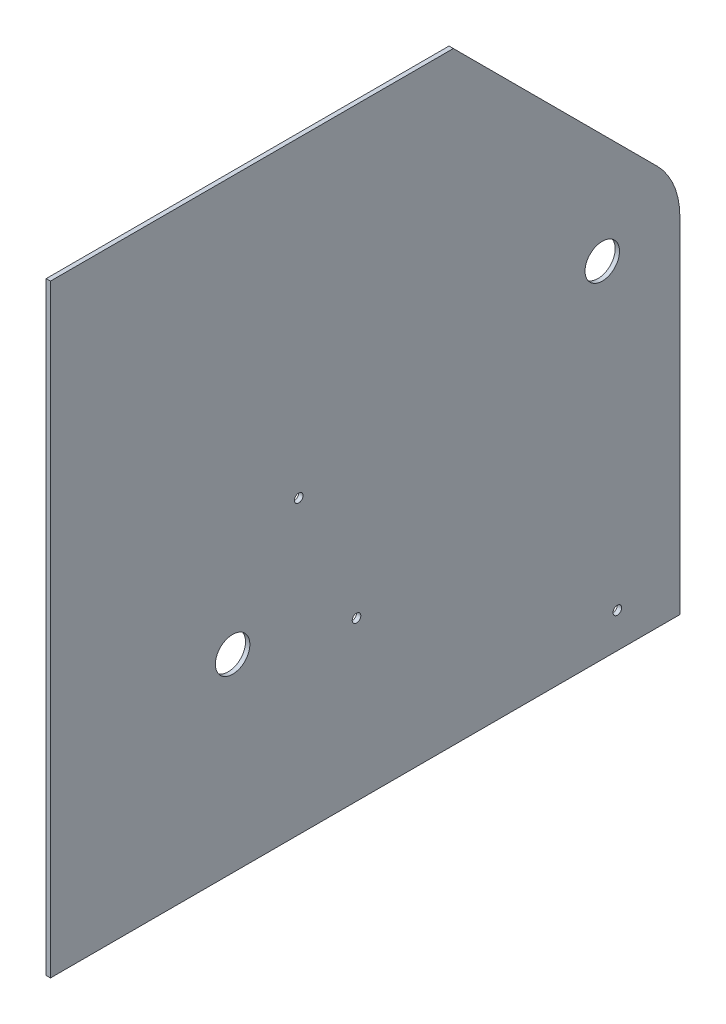
ISO-10303-21;
HEADER;
FILE_DESCRIPTION(('STEP AP214'),'2;1');
FILE_NAME('part.step','',(''),(''),'','','');
FILE_SCHEMA(('AUTOMOTIVE_DESIGN { 1 0 10303 214 1 1 1 1 }'));
ENDSEC;
DATA;
#1=APPLICATION_CONTEXT('core data for automotive mechanical design processes');
#2=APPLICATION_PROTOCOL_DEFINITION('international standard','automotive_design',2000,#1);
#3=PRODUCT_CONTEXT('',#1,'mechanical');
#4=PRODUCT('Part','Part','',(#3));
#5=PRODUCT_RELATED_PRODUCT_CATEGORY('part','',(#4));
#6=PRODUCT_DEFINITION_FORMATION('','',#4);
#7=PRODUCT_DEFINITION_CONTEXT('part definition',#1,'design');
#8=PRODUCT_DEFINITION('design','',#6,#7);
#9=PRODUCT_DEFINITION_SHAPE('','',#8);
#10=(LENGTH_UNIT() NAMED_UNIT(*) SI_UNIT(.MILLI.,.METRE.));
#11=(NAMED_UNIT(*) PLANE_ANGLE_UNIT() SI_UNIT($,.RADIAN.));
#12=(NAMED_UNIT(*) SI_UNIT($,.STERADIAN.) SOLID_ANGLE_UNIT());
#13=UNCERTAINTY_MEASURE_WITH_UNIT(LENGTH_MEASURE(1.E-05),#10,'distance_accuracy_value','');
#14=(GEOMETRIC_REPRESENTATION_CONTEXT(3) GLOBAL_UNCERTAINTY_ASSIGNED_CONTEXT((#13)) GLOBAL_UNIT_ASSIGNED_CONTEXT((#10,
#11,#12)) REPRESENTATION_CONTEXT('',''));
#15=CARTESIAN_POINT('',(0.,0.,0.));
#16=DIRECTION('',(0.,0.,1.));
#17=DIRECTION('',(1.,0.,0.));
#18=AXIS2_PLACEMENT_3D('',#15,#16,#17);
#19=CARTESIAN_POINT('',(3.175,0.,0.));
#20=DIRECTION('',(-1.,0.,0.));
#21=DIRECTION('',(0.,0.,1.));
#22=AXIS2_PLACEMENT_3D('',#19,#20,#21);
#23=CYLINDRICAL_SURFACE('',#22,57.1499999999999);
#24=DIRECTION('',(1.,0.,0.));
#25=VECTOR('',#24,1.);
#26=CARTESIAN_POINT('',(-631.886391748424,40.4111525448111,-40.411152544811));
#27=LINE('',#26,#25);
#28=CARTESIAN_POINT('',(0.,40.4111525448112,-40.411152544811));
#29=VERTEX_POINT('',#28);
#30=CARTESIAN_POINT('',(3.175,40.4111525448112,-40.411152544811));
#31=VERTEX_POINT('',#30);
#32=EDGE_CURVE('E58',#29,#31,#27,.T.);
#33=ORIENTED_EDGE('',*,*,#32,.T.);
#34=CARTESIAN_POINT('',(3.175,0.,0.));
#35=DIRECTION('',(1.,0.,0.));
#36=DIRECTION('',(0.,0.,-1.));
#37=AXIS2_PLACEMENT_3D('',#34,#35,#36);
#38=CIRCLE('',#37,57.1499999999999);
#39=CARTESIAN_POINT('',(3.175,0.,-57.1499999999999));
#40=VERTEX_POINT('',#39);
#41=EDGE_CURVE('E149',#40,#31,#38,.T.);
#42=ORIENTED_EDGE('',*,*,#41,.F.);
#43=DIRECTION('',(-1.,0.,0.));
#44=VECTOR('',#43,1.);
#45=CARTESIAN_POINT('',(3.175,0.,-57.1499999999999));
#46=LINE('',#45,#44);
#47=CARTESIAN_POINT('',(0.,0.,-57.1499999999999));
#48=VERTEX_POINT('',#47);
#49=EDGE_CURVE('E151',#40,#48,#46,.T.);
#50=ORIENTED_EDGE('',*,*,#49,.T.);
#51=CARTESIAN_POINT('',(0.,0.,0.));
#52=DIRECTION('',(1.,0.,0.));
#53=DIRECTION('',(0.,0.,-1.));
#54=AXIS2_PLACEMENT_3D('',#51,#52,#53);
#55=CIRCLE('',#54,57.1499999999999);
#56=EDGE_CURVE('E147',#48,#29,#55,.T.);
#57=ORIENTED_EDGE('',*,*,#56,.T.);
#58=EDGE_LOOP('',(#33,#42,#50,#57));
#59=FACE_BOUND('',#58,.T.);
#60=ADVANCED_FACE('F36',(#59),#23,.T.);
#61=CARTESIAN_POINT('',(3.175,0.,0.));
#62=DIRECTION('',(1.,0.,0.));
#63=DIRECTION('',(0.,0.,-1.));
#64=AXIS2_PLACEMENT_3D('',#61,#62,#63);
#65=PLANE('',#64);
#66=DIRECTION('',(0.,0.,-1.));
#67=VECTOR('',#66,1.);
#68=CARTESIAN_POINT('',(3.175,190.5,406.4));
#69=LINE('',#68,#67);
#70=CARTESIAN_POINT('',(3.175,190.5,406.4));
#71=VERTEX_POINT('',#70);
#72=CARTESIAN_POINT('',(3.175,190.5,109.677694910379));
#73=VERTEX_POINT('',#72);
#74=EDGE_CURVE('E50',#71,#73,#69,.T.);
#75=ORIENTED_EDGE('',*,*,#74,.F.);
#76=DIRECTION('',(0.,-1.,0.));
#77=VECTOR('',#76,1.);
#78=CARTESIAN_POINT('',(3.175,-254.,406.4));
#79=LINE('',#78,#77);
#80=CARTESIAN_POINT('',(3.175,-254.,406.4));
#81=VERTEX_POINT('',#80);
#82=EDGE_CURVE('E101',#71,#81,#79,.T.);
#83=ORIENTED_EDGE('',*,*,#82,.T.);
#84=DIRECTION('',(0.,0.,-1.));
#85=VECTOR('',#84,1.);
#86=CARTESIAN_POINT('',(3.175,-254.,-57.15));
#87=LINE('',#86,#85);
#88=CARTESIAN_POINT('',(3.175,-254.,-57.15));
#89=VERTEX_POINT('',#88);
#90=EDGE_CURVE('E144',#81,#89,#87,.T.);
#91=ORIENTED_EDGE('',*,*,#90,.T.);
#92=DIRECTION('',(0.,1.,0.));
#93=VECTOR('',#92,1.);
#94=CARTESIAN_POINT('',(3.175,0.,-57.15));
#95=LINE('',#94,#93);
#96=EDGE_CURVE('E146',#89,#40,#95,.T.);
#97=ORIENTED_EDGE('',*,*,#96,.T.);
#98=ORIENTED_EDGE('',*,*,#41,.T.);
#99=DIRECTION('',(0.,0.707106781186546,0.707106781186549));
#100=VECTOR('',#99,1.);
#101=CARTESIAN_POINT('',(3.175,40.4111525448111,-40.411152544811));
#102=LINE('',#101,#100);
#103=EDGE_CURVE('E104',#31,#73,#102,.T.);
#104=ORIENTED_EDGE('',*,*,#103,.T.);
#105=EDGE_LOOP('',(#75,#83,#91,#97,#98,#104));
#106=FACE_BOUND('',#105,.T.);
#107=CARTESIAN_POINT('',(3.175,-114.629596606952,272.235522473374));
#108=DIRECTION('',(1.,0.,0.));
#109=DIRECTION('',(0.,0.,-1.));
#110=AXIS2_PLACEMENT_3D('',#107,#108,#109);
#111=CIRCLE('',#110,12.7);
#112=CARTESIAN_POINT('',(3.175,-114.629596606952,259.535522473374));
#113=VERTEX_POINT('',#112);
#114=EDGE_CURVE('E115',#113,#113,#111,.T.);
#115=ORIENTED_EDGE('',*,*,#114,.F.);
#116=EDGE_LOOP('',(#115));
#117=FACE_BOUND('',#116,.T.);
#118=CARTESIAN_POINT('',(3.175,-137.156185968354,180.989788444896));
#119=DIRECTION('',(1.,0.,0.));
#120=DIRECTION('',(0.,0.,-1.));
#121=AXIS2_PLACEMENT_3D('',#118,#119,#120);
#122=CIRCLE('',#121,3.17499999999997);
#123=CARTESIAN_POINT('',(3.175,-137.156185968354,177.814788444896));
#124=VERTEX_POINT('',#123);
#125=EDGE_CURVE('E119',#124,#124,#122,.T.);
#126=ORIENTED_EDGE('',*,*,#125,.F.);
#127=EDGE_LOOP('',(#126));
#128=FACE_BOUND('',#127,.T.);
#129=CARTESIAN_POINT('',(3.175,-39.2772450904559,223.548763186676));
#130=DIRECTION('',(1.,0.,0.));
#131=DIRECTION('',(0.,0.,-1.));
#132=AXIS2_PLACEMENT_3D('',#129,#130,#131);
#133=CIRCLE('',#132,3.175);
#134=CARTESIAN_POINT('',(3.175,-39.2772450904559,220.373763186676));
#135=VERTEX_POINT('',#134);
#136=EDGE_CURVE('E127',#135,#135,#133,.T.);
#137=ORIENTED_EDGE('',*,*,#136,.F.);
#138=EDGE_LOOP('',(#137));
#139=FACE_BOUND('',#138,.T.);
#140=CARTESIAN_POINT('',(3.175,-228.181271675795,-11.1032891519149));
#141=DIRECTION('',(1.,0.,0.));
#142=DIRECTION('',(0.,0.,-1.));
#143=AXIS2_PLACEMENT_3D('',#140,#141,#142);
#144=CIRCLE('',#143,3.175);
#145=CARTESIAN_POINT('',(3.175,-228.181271675795,-14.2782891519149));
#146=VERTEX_POINT('',#145);
#147=EDGE_CURVE('E126',#146,#146,#144,.T.);
#148=ORIENTED_EDGE('',*,*,#147,.F.);
#149=EDGE_LOOP('',(#148));
#150=FACE_BOUND('',#149,.T.);
#151=CARTESIAN_POINT('',(3.175,0.,0.));
#152=DIRECTION('',(1.,0.,0.));
#153=DIRECTION('',(0.,0.,-1.));
#154=AXIS2_PLACEMENT_3D('',#151,#152,#153);
#155=CIRCLE('',#154,12.7);
#156=CARTESIAN_POINT('',(3.175,0.,-12.7));
#157=VERTEX_POINT('',#156);
#158=EDGE_CURVE('E138',#157,#157,#155,.T.);
#159=ORIENTED_EDGE('',*,*,#158,.F.);
#160=EDGE_LOOP('',(#159));
#161=FACE_BOUND('',#160,.T.);
#162=ADVANCED_FACE('F99',(#106,#117,#128,#139,#150,#161),#65,.T.);
#163=CARTESIAN_POINT('',(0.,0.,0.));
#164=DIRECTION('',(1.,0.,0.));
#165=DIRECTION('',(0.,0.,-1.));
#166=AXIS2_PLACEMENT_3D('',#163,#164,#165);
#167=PLANE('',#166);
#168=CARTESIAN_POINT('',(0.,-114.629596606952,272.235522473374));
#169=DIRECTION('',(1.,0.,0.));
#170=DIRECTION('',(0.,0.,-1.));
#171=AXIS2_PLACEMENT_3D('',#168,#169,#170);
#172=CIRCLE('',#171,12.7);
#173=CARTESIAN_POINT('',(0.,-114.629596606952,259.535522473374));
#174=VERTEX_POINT('',#173);
#175=EDGE_CURVE('E110',#174,#174,#172,.F.);
#176=ORIENTED_EDGE('',*,*,#175,.F.);
#177=EDGE_LOOP('',(#176));
#178=FACE_BOUND('',#177,.T.);
#179=CARTESIAN_POINT('',(0.,-137.156185968354,180.989788444896));
#180=DIRECTION('',(1.,0.,0.));
#181=DIRECTION('',(0.,0.,-1.));
#182=AXIS2_PLACEMENT_3D('',#179,#180,#181);
#183=CIRCLE('',#182,3.17499999999997);
#184=CARTESIAN_POINT('',(0.,-137.156185968354,177.814788444896));
#185=VERTEX_POINT('',#184);
#186=EDGE_CURVE('E122',#185,#185,#183,.F.);
#187=ORIENTED_EDGE('',*,*,#186,.F.);
#188=EDGE_LOOP('',(#187));
#189=FACE_BOUND('',#188,.T.);
#190=CARTESIAN_POINT('',(0.,-39.2772450904559,223.548763186676));
#191=DIRECTION('',(1.,0.,0.));
#192=DIRECTION('',(0.,0.,-1.));
#193=AXIS2_PLACEMENT_3D('',#190,#191,#192);
#194=CIRCLE('',#193,3.175);
#195=CARTESIAN_POINT('',(0.,-39.2772450904559,220.373763186676));
#196=VERTEX_POINT('',#195);
#197=EDGE_CURVE('E123',#196,#196,#194,.F.);
#198=ORIENTED_EDGE('',*,*,#197,.F.);
#199=EDGE_LOOP('',(#198));
#200=FACE_BOUND('',#199,.T.);
#201=CARTESIAN_POINT('',(0.,-228.181271675795,-11.1032891519149));
#202=DIRECTION('',(1.,0.,0.));
#203=DIRECTION('',(0.,0.,-1.));
#204=AXIS2_PLACEMENT_3D('',#201,#202,#203);
#205=CIRCLE('',#204,3.175);
#206=CARTESIAN_POINT('',(0.,-228.181271675795,-14.2782891519149));
#207=VERTEX_POINT('',#206);
#208=EDGE_CURVE('E134',#207,#207,#205,.F.);
#209=ORIENTED_EDGE('',*,*,#208,.F.);
#210=EDGE_LOOP('',(#209));
#211=FACE_BOUND('',#210,.T.);
#212=DIRECTION('',(0.,1.,0.));
#213=VECTOR('',#212,1.);
#214=CARTESIAN_POINT('',(0.,-254.,406.4));
#215=LINE('',#214,#213);
#216=CARTESIAN_POINT('',(0.,-254.,406.4));
#217=VERTEX_POINT('',#216);
#218=CARTESIAN_POINT('',(0.,190.5,406.4));
#219=VERTEX_POINT('',#218);
#220=EDGE_CURVE('E112',#217,#219,#215,.T.);
#221=ORIENTED_EDGE('',*,*,#220,.T.);
#222=DIRECTION('',(0.,0.,1.));
#223=VECTOR('',#222,1.);
#224=CARTESIAN_POINT('',(0.,190.5,406.4));
#225=LINE('',#224,#223);
#226=CARTESIAN_POINT('',(0.,190.5,109.677694910379));
#227=VERTEX_POINT('',#226);
#228=EDGE_CURVE('E91',#227,#219,#225,.T.);
#229=ORIENTED_EDGE('',*,*,#228,.F.);
#230=DIRECTION('',(0.,-0.707106781186546,-0.707106781186549));
#231=VECTOR('',#230,1.);
#232=CARTESIAN_POINT('',(0.,40.4111525448111,-40.411152544811));
#233=LINE('',#232,#231);
#234=EDGE_CURVE('E170',#227,#29,#233,.T.);
#235=ORIENTED_EDGE('',*,*,#234,.T.);
#236=ORIENTED_EDGE('',*,*,#56,.F.);
#237=DIRECTION('',(0.,1.,0.));
#238=VECTOR('',#237,1.);
#239=CARTESIAN_POINT('',(0.,0.,-57.15));
#240=LINE('',#239,#238);
#241=CARTESIAN_POINT('',(0.,-254.,-57.15));
#242=VERTEX_POINT('',#241);
#243=EDGE_CURVE('E153',#242,#48,#240,.T.);
#244=ORIENTED_EDGE('',*,*,#243,.F.);
#245=DIRECTION('',(0.,0.,-1.));
#246=VECTOR('',#245,1.);
#247=CARTESIAN_POINT('',(0.,-254.,-57.15));
#248=LINE('',#247,#246);
#249=EDGE_CURVE('E141',#217,#242,#248,.T.);
#250=ORIENTED_EDGE('',*,*,#249,.F.);
#251=EDGE_LOOP('',(#221,#229,#235,#236,#244,#250));
#252=FACE_BOUND('',#251,.T.);
#253=CARTESIAN_POINT('',(0.,0.,0.));
#254=DIRECTION('',(1.,0.,0.));
#255=DIRECTION('',(0.,0.,-1.));
#256=AXIS2_PLACEMENT_3D('',#253,#254,#255);
#257=CIRCLE('',#256,12.7);
#258=CARTESIAN_POINT('',(0.,0.,-12.7));
#259=VERTEX_POINT('',#258);
#260=EDGE_CURVE('E137',#259,#259,#257,.T.);
#261=ORIENTED_EDGE('',*,*,#260,.T.);
#262=EDGE_LOOP('',(#261));
#263=FACE_BOUND('',#262,.T.);
#264=ADVANCED_FACE('F167',(#178,#189,#200,#211,#252,#263),#167,.F.);
#265=CARTESIAN_POINT('',(3.175,-254.,-57.15));
#266=DIRECTION('',(0.,1.,0.));
#267=DIRECTION('',(0.,0.,1.));
#268=AXIS2_PLACEMENT_3D('',#265,#266,#267);
#269=PLANE('',#268);
#270=ORIENTED_EDGE('',*,*,#249,.T.);
#271=DIRECTION('',(-1.,0.,0.));
#272=VECTOR('',#271,1.);
#273=CARTESIAN_POINT('',(3.175,-254.,-57.15));
#274=LINE('',#273,#272);
#275=EDGE_CURVE('E44',#89,#242,#274,.T.);
#276=ORIENTED_EDGE('',*,*,#275,.F.);
#277=ORIENTED_EDGE('',*,*,#90,.F.);
#278=DIRECTION('',(1.,0.,0.));
#279=VECTOR('',#278,1.);
#280=CARTESIAN_POINT('',(-483.713784393242,-254.,406.4));
#281=LINE('',#280,#279);
#282=EDGE_CURVE('E109',#217,#81,#281,.T.);
#283=ORIENTED_EDGE('',*,*,#282,.F.);
#284=EDGE_LOOP('',(#270,#276,#277,#283));
#285=FACE_BOUND('',#284,.T.);
#286=ADVANCED_FACE('F38',(#285),#269,.F.);
#287=CARTESIAN_POINT('',(3.175,0.,-57.15));
#288=DIRECTION('',(0.,0.,1.));
#289=DIRECTION('',(1.,0.,0.));
#290=AXIS2_PLACEMENT_3D('',#287,#288,#289);
#291=PLANE('',#290);
#292=ORIENTED_EDGE('',*,*,#243,.T.);
#293=ORIENTED_EDGE('',*,*,#49,.F.);
#294=ORIENTED_EDGE('',*,*,#96,.F.);
#295=ORIENTED_EDGE('',*,*,#275,.T.);
#296=EDGE_LOOP('',(#292,#293,#294,#295));
#297=FACE_BOUND('',#296,.T.);
#298=ADVANCED_FACE('F162',(#297),#291,.F.);
#299=CARTESIAN_POINT('',(3.175,0.,0.));
#300=DIRECTION('',(-1.,0.,0.));
#301=DIRECTION('',(0.,0.,1.));
#302=AXIS2_PLACEMENT_3D('',#299,#300,#301);
#303=CYLINDRICAL_SURFACE('',#302,12.7);
#304=ORIENTED_EDGE('',*,*,#158,.T.);
#305=EDGE_LOOP('',(#304));
#306=FACE_BOUND('',#305,.T.);
#307=ORIENTED_EDGE('',*,*,#260,.F.);
#308=EDGE_LOOP('',(#307));
#309=FACE_BOUND('',#308,.T.);
#310=ADVANCED_FACE('F194',(#306,#309),#303,.F.);
#311=CARTESIAN_POINT('',(-0.00100000000000013,-228.181271675795,-11.1032891519149));
#312=DIRECTION('',(1.,0.,0.));
#313=DIRECTION('',(0.,0.,-1.));
#314=AXIS2_PLACEMENT_3D('',#311,#312,#313);
#315=CYLINDRICAL_SURFACE('',#314,3.175);
#316=ORIENTED_EDGE('',*,*,#147,.T.);
#317=EDGE_LOOP('',(#316));
#318=FACE_BOUND('',#317,.T.);
#319=ORIENTED_EDGE('',*,*,#208,.T.);
#320=EDGE_LOOP('',(#319));
#321=FACE_BOUND('',#320,.T.);
#322=ADVANCED_FACE('F197',(#318,#321),#315,.F.);
#323=CARTESIAN_POINT('',(-0.00100000000000013,-39.2772450904559,223.548763186676));
#324=DIRECTION('',(1.,0.,0.));
#325=DIRECTION('',(0.,0.,-1.));
#326=AXIS2_PLACEMENT_3D('',#323,#324,#325);
#327=CYLINDRICAL_SURFACE('',#326,3.175);
#328=ORIENTED_EDGE('',*,*,#136,.T.);
#329=EDGE_LOOP('',(#328));
#330=FACE_BOUND('',#329,.T.);
#331=ORIENTED_EDGE('',*,*,#197,.T.);
#332=EDGE_LOOP('',(#331));
#333=FACE_BOUND('',#332,.T.);
#334=ADVANCED_FACE('F227',(#330,#333),#327,.F.);
#335=CARTESIAN_POINT('',(-0.00100000000000013,-137.156185968354,180.989788444896));
#336=DIRECTION('',(1.,0.,0.));
#337=DIRECTION('',(0.,0.,-1.));
#338=AXIS2_PLACEMENT_3D('',#335,#336,#337);
#339=CYLINDRICAL_SURFACE('',#338,3.17499999999997);
#340=ORIENTED_EDGE('',*,*,#125,.T.);
#341=EDGE_LOOP('',(#340));
#342=FACE_BOUND('',#341,.T.);
#343=ORIENTED_EDGE('',*,*,#186,.T.);
#344=EDGE_LOOP('',(#343));
#345=FACE_BOUND('',#344,.T.);
#346=ADVANCED_FACE('F235',(#342,#345),#339,.F.);
#347=CARTESIAN_POINT('',(-483.713784393242,-254.,406.4));
#348=DIRECTION('',(0.,0.,1.));
#349=DIRECTION('',(1.,0.,0.));
#350=AXIS2_PLACEMENT_3D('',#347,#348,#349);
#351=PLANE('',#350);
#352=DIRECTION('',(1.,0.,0.));
#353=VECTOR('',#352,1.);
#354=CARTESIAN_POINT('',(-1025.77266744136,190.5,406.4));
#355=LINE('',#354,#353);
#356=EDGE_CURVE('E88',#219,#71,#355,.T.);
#357=ORIENTED_EDGE('',*,*,#356,.F.);
#358=ORIENTED_EDGE('',*,*,#220,.F.);
#359=ORIENTED_EDGE('',*,*,#282,.T.);
#360=ORIENTED_EDGE('',*,*,#82,.F.);
#361=EDGE_LOOP('',(#357,#358,#359,#360));
#362=FACE_BOUND('',#361,.T.);
#363=ADVANCED_FACE('F107',(#362),#351,.T.);
#364=CARTESIAN_POINT('',(-0.00100000000000013,-114.629596606952,272.235522473374));
#365=DIRECTION('',(1.,0.,0.));
#366=DIRECTION('',(0.,0.,-1.));
#367=AXIS2_PLACEMENT_3D('',#364,#365,#366);
#368=CYLINDRICAL_SURFACE('',#367,12.7);
#369=ORIENTED_EDGE('',*,*,#114,.T.);
#370=EDGE_LOOP('',(#369));
#371=FACE_BOUND('',#370,.T.);
#372=ORIENTED_EDGE('',*,*,#175,.T.);
#373=EDGE_LOOP('',(#372));
#374=FACE_BOUND('',#373,.T.);
#375=ADVANCED_FACE('F181',(#371,#374),#368,.F.);
#376=CARTESIAN_POINT('',(-631.886391748424,40.4111525448111,-40.411152544811));
#377=DIRECTION('',(0.,0.707106781186549,-0.707106781186546));
#378=DIRECTION('',(0.,0.707106781186546,0.707106781186549));
#379=AXIS2_PLACEMENT_3D('',#376,#377,#378);
#380=PLANE('',#379);
#381=DIRECTION('',(-1.,0.,0.));
#382=VECTOR('',#381,1.);
#383=CARTESIAN_POINT('',(-631.886391748424,190.5,109.677694910378));
#384=LINE('',#383,#382);
#385=EDGE_CURVE('E11',#73,#227,#384,.T.);
#386=ORIENTED_EDGE('',*,*,#385,.F.);
#387=ORIENTED_EDGE('',*,*,#103,.F.);
#388=ORIENTED_EDGE('',*,*,#32,.F.);
#389=ORIENTED_EDGE('',*,*,#234,.F.);
#390=EDGE_LOOP('',(#386,#387,#388,#389));
#391=FACE_BOUND('',#390,.T.);
#392=ADVANCED_FACE('F172',(#391),#380,.T.);
#393=CARTESIAN_POINT('',(-1025.77266744136,190.5,406.4));
#394=DIRECTION('',(0.,-1.,0.));
#395=DIRECTION('',(0.,0.,-1.));
#396=AXIS2_PLACEMENT_3D('',#393,#394,#395);
#397=PLANE('',#396);
#398=ORIENTED_EDGE('',*,*,#385,.T.);
#399=ORIENTED_EDGE('',*,*,#228,.T.);
#400=ORIENTED_EDGE('',*,*,#356,.T.);
#401=ORIENTED_EDGE('',*,*,#74,.T.);
#402=EDGE_LOOP('',(#398,#399,#400,#401));
#403=FACE_BOUND('',#402,.T.);
#404=ADVANCED_FACE('F89',(#403),#397,.F.);
#405=CLOSED_SHELL('',(#60,#162,#264,#286,#298,#310,#322,#334,#346,#363,#375,#392,#404));
#406=MANIFOLD_SOLID_BREP('B2',#405);
#407=ADVANCED_BREP_SHAPE_REPRESENTATION('',(#18,#406),#14);
#408=SHAPE_DEFINITION_REPRESENTATION(#9,#407);
ENDSEC;
END-ISO-10303-21;
